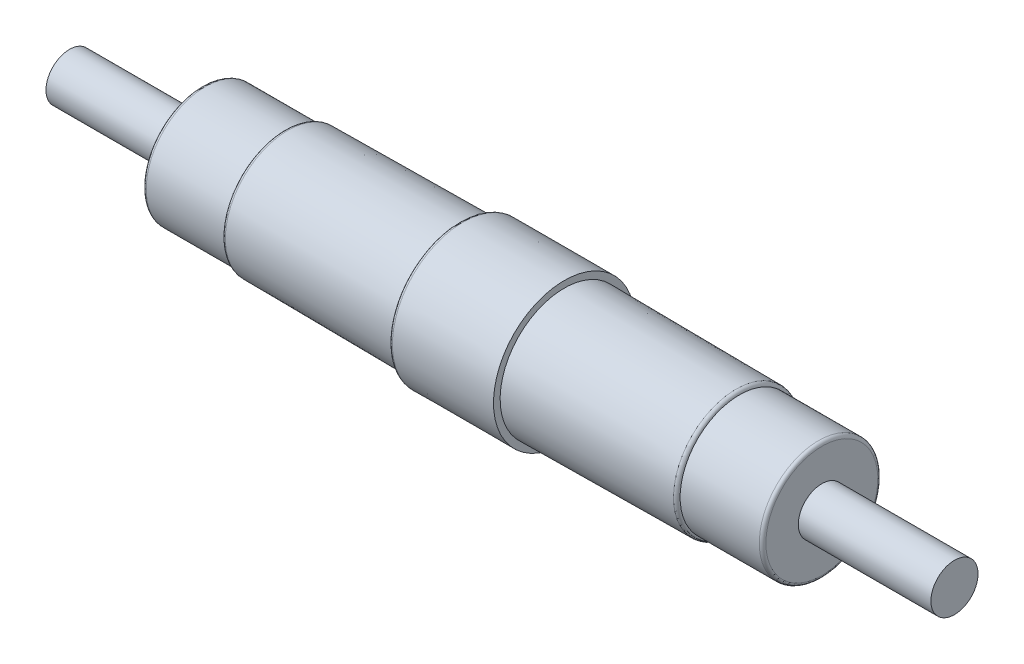
ISO-10303-21;
HEADER;
FILE_DESCRIPTION(('STEP AP214'),'2;1');
FILE_NAME('part.step','',(''),(''),'','','');
FILE_SCHEMA(('AUTOMOTIVE_DESIGN { 1 0 10303 214 1 1 1 1 }'));
ENDSEC;
DATA;
#1=APPLICATION_CONTEXT('core data for automotive mechanical design processes');
#2=APPLICATION_PROTOCOL_DEFINITION('international standard','automotive_design',2000,#1);
#3=PRODUCT_CONTEXT('',#1,'mechanical');
#4=PRODUCT('Part','Part','',(#3));
#5=PRODUCT_RELATED_PRODUCT_CATEGORY('part','',(#4));
#6=PRODUCT_DEFINITION_FORMATION('','',#4);
#7=PRODUCT_DEFINITION_CONTEXT('part definition',#1,'design');
#8=PRODUCT_DEFINITION('design','',#6,#7);
#9=PRODUCT_DEFINITION_SHAPE('','',#8);
#10=(LENGTH_UNIT() NAMED_UNIT(*) SI_UNIT(.MILLI.,.METRE.));
#11=(NAMED_UNIT(*) PLANE_ANGLE_UNIT() SI_UNIT($,.RADIAN.));
#12=(NAMED_UNIT(*) SI_UNIT($,.STERADIAN.) SOLID_ANGLE_UNIT());
#13=UNCERTAINTY_MEASURE_WITH_UNIT(LENGTH_MEASURE(1.E-05),#10,'distance_accuracy_value','');
#14=(GEOMETRIC_REPRESENTATION_CONTEXT(3) GLOBAL_UNCERTAINTY_ASSIGNED_CONTEXT((#13)) GLOBAL_UNIT_ASSIGNED_CONTEXT((#10,
#11,#12)) REPRESENTATION_CONTEXT('',''));
#15=CARTESIAN_POINT('',(0.,0.,0.));
#16=DIRECTION('',(0.,0.,1.));
#17=DIRECTION('',(1.,0.,0.));
#18=AXIS2_PLACEMENT_3D('',#15,#16,#17);
#19=CARTESIAN_POINT('',(23.118,0.,0.));
#20=DIRECTION('',(1.,0.,0.));
#21=DIRECTION('',(0.,0.,-1.));
#22=AXIS2_PLACEMENT_3D('',#19,#20,#21);
#23=TOROIDAL_SURFACE('',#22,4.22087722221174,0.25);
#24=CARTESIAN_POINT('',(23.368,0.,0.));
#25=DIRECTION('',(1.,0.,0.));
#26=DIRECTION('',(0.,1.,0.));
#27=AXIS2_PLACEMENT_3D('',#24,#25,#26);
#28=CIRCLE('',#27,4.22087722221174);
#29=CARTESIAN_POINT('',(23.368,0.,4.22087722221174));
#30=VERTEX_POINT('',#29);
#31=EDGE_CURVE('E37',#30,#30,#28,.T.);
#32=ORIENTED_EDGE('',*,*,#31,.F.);
#33=EDGE_LOOP('',(#32));
#34=FACE_BOUND('',#33,.T.);
#35=CARTESIAN_POINT('',(23.118,0.,0.));
#36=DIRECTION('',(1.,0.,0.));
#37=DIRECTION('',(0.,1.,0.));
#38=AXIS2_PLACEMENT_3D('',#35,#36,#37);
#39=CIRCLE('',#38,4.47087722221174);
#40=CARTESIAN_POINT('',(23.118,-4.47087722221174,0.));
#41=VERTEX_POINT('',#40);
#42=EDGE_CURVE('E9',#41,#41,#39,.T.);
#43=ORIENTED_EDGE('',*,*,#42,.T.);
#44=EDGE_LOOP('',(#43));
#45=FACE_BOUND('',#44,.T.);
#46=ADVANCED_FACE('F14',(#34,#45),#23,.T.);
#47=CARTESIAN_POINT('',(20.13404,0.,0.));
#48=DIRECTION('',(1.,0.,0.));
#49=DIRECTION('',(0.,1.,0.));
#50=AXIS2_PLACEMENT_3D('',#47,#48,#49);
#51=CYLINDRICAL_SURFACE('',#50,4.47087722221174);
#52=ORIENTED_EDGE('',*,*,#42,.F.);
#53=EDGE_LOOP('',(#52));
#54=FACE_BOUND('',#53,.T.);
#55=CARTESIAN_POINT('',(17.15008,0.,0.));
#56=DIRECTION('',(1.,0.,0.));
#57=DIRECTION('',(0.,1.,0.));
#58=AXIS2_PLACEMENT_3D('',#55,#56,#57);
#59=CIRCLE('',#58,4.47087722221174);
#60=CARTESIAN_POINT('',(17.15008,0.,-4.47087722221174));
#61=VERTEX_POINT('',#60);
#62=EDGE_CURVE('E25',#61,#61,#59,.T.);
#63=ORIENTED_EDGE('',*,*,#62,.T.);
#64=EDGE_LOOP('',(#63));
#65=FACE_BOUND('',#64,.T.);
#66=ADVANCED_FACE('F212',(#54,#65),#51,.T.);
#67=CARTESIAN_POINT('',(16.90008,0.,0.));
#68=DIRECTION('',(1.,0.,0.));
#69=DIRECTION('',(0.,0.,-1.));
#70=AXIS2_PLACEMENT_3D('',#67,#68,#69);
#71=TOROIDAL_SURFACE('',#70,4.47087722221174,0.249999999999996);
#72=ORIENTED_EDGE('',*,*,#62,.F.);
#73=EDGE_LOOP('',(#72));
#74=FACE_BOUND('',#73,.T.);
#75=CARTESIAN_POINT('',(16.90008,0.,0.));
#76=DIRECTION('',(1.,0.,0.));
#77=DIRECTION('',(0.,1.,0.));
#78=AXIS2_PLACEMENT_3D('',#75,#76,#77);
#79=CIRCLE('',#78,4.72087722221174);
#80=CARTESIAN_POINT('',(16.90008,-4.72087722221174,0.));
#81=VERTEX_POINT('',#80);
#82=EDGE_CURVE('E18',#81,#81,#79,.T.);
#83=ORIENTED_EDGE('',*,*,#82,.T.);
#84=EDGE_LOOP('',(#83));
#85=FACE_BOUND('',#84,.T.);
#86=ADVANCED_FACE('F217',(#74,#85),#71,.T.);
#87=CARTESIAN_POINT('',(10.419033584968,0.,0.));
#88=DIRECTION('',(-1.,0.,0.));
#89=DIRECTION('',(0.,1.,0.));
#90=AXIS2_PLACEMENT_3D('',#87,#88,#89);
#91=CONICAL_SURFACE('',#90,4.7774364574215,0.00872664625995653);
#92=ORIENTED_EDGE('',*,*,#82,.F.);
#93=EDGE_LOOP('',(#92));
#94=FACE_BOUND('',#93,.T.);
#95=CARTESIAN_POINT('',(3.93798716993606,0.,0.));
#96=DIRECTION('',(1.,0.,0.));
#97=DIRECTION('',(0.,1.,0.));
#98=AXIS2_PLACEMENT_3D('',#95,#96,#97);
#99=CIRCLE('',#98,4.83399569263125);
#100=CARTESIAN_POINT('',(3.93798716993606,-4.83399569263126,0.));
#101=VERTEX_POINT('',#100);
#102=EDGE_CURVE('E90',#101,#101,#99,.T.);
#103=ORIENTED_EDGE('',*,*,#102,.T.);
#104=EDGE_LOOP('',(#103));
#105=FACE_BOUND('',#104,.T.);
#106=ADVANCED_FACE('F86',(#94,#105),#91,.T.);
#107=CARTESIAN_POINT('',(0.125246787785379,0.,0.));
#108=DIRECTION('',(-1.,0.,0.));
#109=DIRECTION('',(0.,1.,0.));
#110=AXIS2_PLACEMENT_3D('',#107,#108,#109);
#111=CONICAL_SURFACE('',#110,5.334,5.64869982630763E-07);
#112=CARTESIAN_POINT('',(3.93798716993606,0.,0.));
#113=DIRECTION('',(1.,0.,0.));
#114=DIRECTION('',(0.,1.,0.));
#115=AXIS2_PLACEMENT_3D('',#112,#113,#114);
#116=CIRCLE('',#115,5.33399784631563);
#117=CARTESIAN_POINT('',(3.93798716993606,-5.33399784631563,0.));
#118=VERTEX_POINT('',#117);
#119=EDGE_CURVE('E132',#118,#118,#116,.T.);
#120=ORIENTED_EDGE('',*,*,#119,.F.);
#121=EDGE_LOOP('',(#120));
#122=FACE_BOUND('',#121,.T.);
#123=CARTESIAN_POINT('',(-3.6874935943653,0.,0.));
#124=DIRECTION('',(1.,0.,0.));
#125=DIRECTION('',(0.,1.,0.));
#126=AXIS2_PLACEMENT_3D('',#123,#124,#125);
#127=CIRCLE('',#126,5.33400215368437);
#128=CARTESIAN_POINT('',(-3.6874935943653,0.,-5.33400215368437));
#129=VERTEX_POINT('',#128);
#130=EDGE_CURVE('E98',#129,#129,#127,.T.);
#131=ORIENTED_EDGE('',*,*,#130,.T.);
#132=EDGE_LOOP('',(#131));
#133=FACE_BOUND('',#132,.T.);
#134=ADVANCED_FACE('F223',(#122,#133),#111,.T.);
#135=CARTESIAN_POINT('',(-3.6874935943653,0.,0.));
#136=DIRECTION('',(1.,0.,0.));
#137=DIRECTION('',(0.,0.,-1.));
#138=AXIS2_PLACEMENT_3D('',#135,#136,#137);
#139=TOROIDAL_SURFACE('',#138,5.08400215368437,0.25);
#140=ORIENTED_EDGE('',*,*,#130,.F.);
#141=EDGE_LOOP('',(#140));
#142=FACE_BOUND('',#141,.T.);
#143=CARTESIAN_POINT('',(-3.9374935943653,0.,0.));
#144=DIRECTION('',(1.,0.,0.));
#145=DIRECTION('',(0.,1.,0.));
#146=AXIS2_PLACEMENT_3D('',#143,#144,#145);
#147=CIRCLE('',#146,5.08400215368437);
#148=CARTESIAN_POINT('',(-3.9374935943653,0.,5.08400215368437));
#149=VERTEX_POINT('',#148);
#150=EDGE_CURVE('E105',#149,#149,#147,.T.);
#151=ORIENTED_EDGE('',*,*,#150,.T.);
#152=EDGE_LOOP('',(#151));
#153=FACE_BOUND('',#152,.T.);
#154=ADVANCED_FACE('F154',(#142,#153),#139,.T.);
#155=CARTESIAN_POINT('',(-10.4187867971827,0.,0.));
#156=DIRECTION('',(1.,0.,0.));
#157=DIRECTION('',(0.,1.,0.));
#158=AXIS2_PLACEMENT_3D('',#155,#156,#157);
#159=CONICAL_SURFACE('',#158,4.77743861110587,0.00872664625996925);
#160=CARTESIAN_POINT('',(-3.9374935943653,0.,0.));
#161=DIRECTION('',(1.,0.,0.));
#162=DIRECTION('',(0.,1.,0.));
#163=AXIS2_PLACEMENT_3D('',#160,#161,#162);
#164=CIRCLE('',#163,4.834);
#165=CARTESIAN_POINT('',(-3.9374935943653,-4.834,0.));
#166=VERTEX_POINT('',#165);
#167=EDGE_CURVE('E135',#166,#166,#164,.T.);
#168=ORIENTED_EDGE('',*,*,#167,.F.);
#169=EDGE_LOOP('',(#168));
#170=FACE_BOUND('',#169,.T.);
#171=CARTESIAN_POINT('',(-16.90008,0.,0.));
#172=DIRECTION('',(1.,0.,0.));
#173=DIRECTION('',(0.,1.,0.));
#174=AXIS2_PLACEMENT_3D('',#171,#172,#173);
#175=CIRCLE('',#174,4.72087722221174);
#176=CARTESIAN_POINT('',(-16.90008,0.,-4.72087722221174));
#177=VERTEX_POINT('',#176);
#178=EDGE_CURVE('E119',#177,#177,#175,.T.);
#179=ORIENTED_EDGE('',*,*,#178,.T.);
#180=EDGE_LOOP('',(#179));
#181=FACE_BOUND('',#180,.T.);
#182=ADVANCED_FACE('F165',(#170,#181),#159,.T.);
#183=CARTESIAN_POINT('',(-16.90008,0.,0.));
#184=DIRECTION('',(1.,0.,0.));
#185=DIRECTION('',(0.,0.,-1.));
#186=AXIS2_PLACEMENT_3D('',#183,#184,#185);
#187=TOROIDAL_SURFACE('',#186,4.47087722221174,0.25);
#188=ORIENTED_EDGE('',*,*,#178,.F.);
#189=EDGE_LOOP('',(#188));
#190=FACE_BOUND('',#189,.T.);
#191=CARTESIAN_POINT('',(-17.15008,0.,0.));
#192=DIRECTION('',(1.,0.,0.));
#193=DIRECTION('',(0.,1.,0.));
#194=AXIS2_PLACEMENT_3D('',#191,#192,#193);
#195=CIRCLE('',#194,4.47087722221174);
#196=CARTESIAN_POINT('',(-17.15008,-4.47087722221174,0.));
#197=VERTEX_POINT('',#196);
#198=EDGE_CURVE('E122',#197,#197,#195,.T.);
#199=ORIENTED_EDGE('',*,*,#198,.T.);
#200=EDGE_LOOP('',(#199));
#201=FACE_BOUND('',#200,.T.);
#202=ADVANCED_FACE('F168',(#190,#201),#187,.T.);
#203=CARTESIAN_POINT('',(-20.13404,0.,0.));
#204=DIRECTION('',(1.,0.,0.));
#205=DIRECTION('',(0.,1.,0.));
#206=AXIS2_PLACEMENT_3D('',#203,#204,#205);
#207=CYLINDRICAL_SURFACE('',#206,4.47087722221174);
#208=ORIENTED_EDGE('',*,*,#198,.F.);
#209=EDGE_LOOP('',(#208));
#210=FACE_BOUND('',#209,.T.);
#211=CARTESIAN_POINT('',(-23.118,0.,0.));
#212=DIRECTION('',(1.,0.,0.));
#213=DIRECTION('',(0.,1.,0.));
#214=AXIS2_PLACEMENT_3D('',#211,#212,#213);
#215=CIRCLE('',#214,4.47087722221174);
#216=CARTESIAN_POINT('',(-23.118,0.,-4.47087722221174));
#217=VERTEX_POINT('',#216);
#218=EDGE_CURVE('E117',#217,#217,#215,.T.);
#219=ORIENTED_EDGE('',*,*,#218,.T.);
#220=EDGE_LOOP('',(#219));
#221=FACE_BOUND('',#220,.T.);
#222=ADVANCED_FACE('F177',(#210,#221),#207,.T.);
#223=CARTESIAN_POINT('',(-23.118,0.,0.));
#224=DIRECTION('',(1.,0.,0.));
#225=DIRECTION('',(0.,0.,-1.));
#226=AXIS2_PLACEMENT_3D('',#223,#224,#225);
#227=TOROIDAL_SURFACE('',#226,4.22087722221174,0.25);
#228=ORIENTED_EDGE('',*,*,#218,.F.);
#229=EDGE_LOOP('',(#228));
#230=FACE_BOUND('',#229,.T.);
#231=CARTESIAN_POINT('',(-23.368,0.,0.));
#232=DIRECTION('',(1.,0.,0.));
#233=DIRECTION('',(0.,1.,0.));
#234=AXIS2_PLACEMENT_3D('',#231,#232,#233);
#235=CIRCLE('',#234,4.22087722221174);
#236=CARTESIAN_POINT('',(-23.368,0.,4.22087722221174));
#237=VERTEX_POINT('',#236);
#238=EDGE_CURVE('E113',#237,#237,#235,.T.);
#239=ORIENTED_EDGE('',*,*,#238,.T.);
#240=EDGE_LOOP('',(#239));
#241=FACE_BOUND('',#240,.T.);
#242=ADVANCED_FACE('F185',(#230,#241),#227,.T.);
#243=CARTESIAN_POINT('',(-28.268,0.,0.));
#244=DIRECTION('',(-1.,0.,0.));
#245=DIRECTION('',(0.,0.,1.));
#246=AXIS2_PLACEMENT_3D('',#243,#244,#245);
#247=CYLINDRICAL_SURFACE('',#246,1.778);
#248=CARTESIAN_POINT('',(-33.368,0.,0.));
#249=DIRECTION('',(-1.,0.,0.));
#250=DIRECTION('',(0.,0.,1.));
#251=AXIS2_PLACEMENT_3D('',#248,#249,#250);
#252=CIRCLE('',#251,1.778);
#253=CARTESIAN_POINT('',(-33.368,0.,-1.778));
#254=VERTEX_POINT('',#253);
#255=EDGE_CURVE('E112',#254,#254,#252,.T.);
#256=ORIENTED_EDGE('',*,*,#255,.F.);
#257=EDGE_LOOP('',(#256));
#258=FACE_BOUND('',#257,.T.);
#259=CARTESIAN_POINT('',(-23.368,0.,0.));
#260=DIRECTION('',(1.,0.,0.));
#261=DIRECTION('',(0.,0.,1.));
#262=AXIS2_PLACEMENT_3D('',#259,#260,#261);
#263=CIRCLE('',#262,1.778);
#264=CARTESIAN_POINT('',(-23.368,0.,-1.778));
#265=VERTEX_POINT('',#264);
#266=EDGE_CURVE('E136',#265,#265,#263,.T.);
#267=ORIENTED_EDGE('',*,*,#266,.F.);
#268=EDGE_LOOP('',(#267));
#269=FACE_BOUND('',#268,.T.);
#270=ADVANCED_FACE('F193',(#258,#269),#247,.T.);
#271=CARTESIAN_POINT('',(28.268,0.,0.));
#272=DIRECTION('',(1.,0.,0.));
#273=DIRECTION('',(0.,0.,-1.));
#274=AXIS2_PLACEMENT_3D('',#271,#272,#273);
#275=CYLINDRICAL_SURFACE('',#274,1.778);
#276=CARTESIAN_POINT('',(33.368,0.,0.));
#277=DIRECTION('',(1.,0.,0.));
#278=DIRECTION('',(0.,0.,-1.));
#279=AXIS2_PLACEMENT_3D('',#276,#277,#278);
#280=CIRCLE('',#279,1.778);
#281=CARTESIAN_POINT('',(33.368,0.,1.778));
#282=VERTEX_POINT('',#281);
#283=EDGE_CURVE('E118',#282,#282,#280,.T.);
#284=ORIENTED_EDGE('',*,*,#283,.F.);
#285=EDGE_LOOP('',(#284));
#286=FACE_BOUND('',#285,.T.);
#287=CARTESIAN_POINT('',(23.368,0.,0.));
#288=DIRECTION('',(-1.,0.,0.));
#289=DIRECTION('',(0.,0.,-1.));
#290=AXIS2_PLACEMENT_3D('',#287,#288,#289);
#291=CIRCLE('',#290,1.778);
#292=CARTESIAN_POINT('',(23.368,0.,1.778));
#293=VERTEX_POINT('',#292);
#294=EDGE_CURVE('E109',#293,#293,#291,.T.);
#295=ORIENTED_EDGE('',*,*,#294,.F.);
#296=EDGE_LOOP('',(#295));
#297=FACE_BOUND('',#296,.T.);
#298=ADVANCED_FACE('F16',(#286,#297),#275,.T.);
#299=CARTESIAN_POINT('',(33.368,0.,0.));
#300=DIRECTION('',(1.,0.,0.));
#301=DIRECTION('',(0.,1.,0.));
#302=AXIS2_PLACEMENT_3D('',#299,#300,#301);
#303=PLANE('',#302);
#304=ORIENTED_EDGE('',*,*,#283,.T.);
#305=EDGE_LOOP('',(#304));
#306=FACE_BOUND('',#305,.T.);
#307=ADVANCED_FACE('F209',(#306),#303,.T.);
#308=CARTESIAN_POINT('',(-33.368,0.,0.));
#309=DIRECTION('',(-1.,0.,0.));
#310=DIRECTION('',(0.,0.,1.));
#311=AXIS2_PLACEMENT_3D('',#308,#309,#310);
#312=PLANE('',#311);
#313=ORIENTED_EDGE('',*,*,#255,.T.);
#314=EDGE_LOOP('',(#313));
#315=FACE_BOUND('',#314,.T.);
#316=ADVANCED_FACE('F225',(#315),#312,.T.);
#317=CARTESIAN_POINT('',(23.368,2.11043861110587,0.));
#318=DIRECTION('',(1.,0.,0.));
#319=DIRECTION('',(0.,1.,0.));
#320=AXIS2_PLACEMENT_3D('',#317,#318,#319);
#321=PLANE('',#320);
#322=ORIENTED_EDGE('',*,*,#31,.T.);
#323=EDGE_LOOP('',(#322));
#324=FACE_BOUND('',#323,.T.);
#325=ORIENTED_EDGE('',*,*,#294,.T.);
#326=EDGE_LOOP('',(#325));
#327=FACE_BOUND('',#326,.T.);
#328=ADVANCED_FACE('F199',(#324,#327),#321,.T.);
#329=CARTESIAN_POINT('',(-23.368,2.11043861110587,0.));
#330=DIRECTION('',(-1.,0.,0.));
#331=DIRECTION('',(0.,0.,1.));
#332=AXIS2_PLACEMENT_3D('',#329,#330,#331);
#333=PLANE('',#332);
#334=ORIENTED_EDGE('',*,*,#238,.F.);
#335=EDGE_LOOP('',(#334));
#336=FACE_BOUND('',#335,.T.);
#337=ORIENTED_EDGE('',*,*,#266,.T.);
#338=EDGE_LOOP('',(#337));
#339=FACE_BOUND('',#338,.T.);
#340=ADVANCED_FACE('F162',(#336,#339),#333,.T.);
#341=CARTESIAN_POINT('',(-3.9374935943653,4.95900107684218,0.));
#342=DIRECTION('',(-1.,0.,0.));
#343=DIRECTION('',(0.,0.,1.));
#344=AXIS2_PLACEMENT_3D('',#341,#342,#343);
#345=PLANE('',#344);
#346=ORIENTED_EDGE('',*,*,#150,.F.);
#347=EDGE_LOOP('',(#346));
#348=FACE_BOUND('',#347,.T.);
#349=ORIENTED_EDGE('',*,*,#167,.T.);
#350=EDGE_LOOP('',(#349));
#351=FACE_BOUND('',#350,.T.);
#352=ADVANCED_FACE('F158',(#348,#351),#345,.T.);
#353=CARTESIAN_POINT('',(3.93798716993606,5.08399676947344,0.));
#354=DIRECTION('',(1.,0.,0.));
#355=DIRECTION('',(0.,1.,0.));
#356=AXIS2_PLACEMENT_3D('',#353,#354,#355);
#357=PLANE('',#356);
#358=ORIENTED_EDGE('',*,*,#119,.T.);
#359=EDGE_LOOP('',(#358));
#360=FACE_BOUND('',#359,.T.);
#361=ORIENTED_EDGE('',*,*,#102,.F.);
#362=EDGE_LOOP('',(#361));
#363=FACE_BOUND('',#362,.T.);
#364=ADVANCED_FACE('F161',(#360,#363),#357,.T.);
#365=CLOSED_SHELL('',(#46,#66,#86,#106,#134,#154,#182,#202,#222,#242,#270,#298,#307,#316,#328,
#340,#352,#364));
#366=MANIFOLD_SOLID_BREP('B1',#365);
#367=ADVANCED_BREP_SHAPE_REPRESENTATION('',(#18,#366),#14);
#368=SHAPE_DEFINITION_REPRESENTATION(#9,#367);
ENDSEC;
END-ISO-10303-21;
